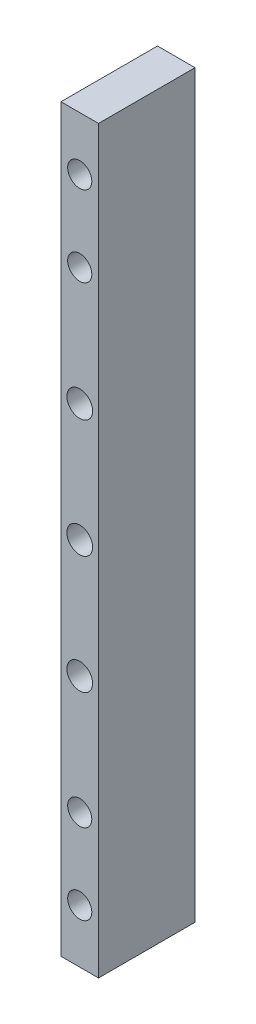
ISO-10303-21;
HEADER;
FILE_DESCRIPTION(('STEP AP214'),'2;1');
FILE_NAME('part.step','',(''),(''),'','','');
FILE_SCHEMA(('AUTOMOTIVE_DESIGN { 1 0 10303 214 1 1 1 1 }'));
ENDSEC;
DATA;
#1=APPLICATION_CONTEXT('core data for automotive mechanical design processes');
#2=APPLICATION_PROTOCOL_DEFINITION('international standard','automotive_design',2000,#1);
#3=PRODUCT_CONTEXT('',#1,'mechanical');
#4=PRODUCT('Part','Part','',(#3));
#5=PRODUCT_RELATED_PRODUCT_CATEGORY('part','',(#4));
#6=PRODUCT_DEFINITION_FORMATION('','',#4);
#7=PRODUCT_DEFINITION_CONTEXT('part definition',#1,'design');
#8=PRODUCT_DEFINITION('design','',#6,#7);
#9=PRODUCT_DEFINITION_SHAPE('','',#8);
#10=(LENGTH_UNIT() NAMED_UNIT(*) SI_UNIT(.MILLI.,.METRE.));
#11=(NAMED_UNIT(*) PLANE_ANGLE_UNIT() SI_UNIT($,.RADIAN.));
#12=(NAMED_UNIT(*) SI_UNIT($,.STERADIAN.) SOLID_ANGLE_UNIT());
#13=UNCERTAINTY_MEASURE_WITH_UNIT(LENGTH_MEASURE(1.E-05),#10,'distance_accuracy_value','');
#14=(GEOMETRIC_REPRESENTATION_CONTEXT(3) GLOBAL_UNCERTAINTY_ASSIGNED_CONTEXT((#13)) GLOBAL_UNIT_ASSIGNED_CONTEXT((#10,
#11,#12)) REPRESENTATION_CONTEXT('',''));
#15=CARTESIAN_POINT('',(0.,0.,0.));
#16=DIRECTION('',(0.,0.,1.));
#17=DIRECTION('',(1.,0.,0.));
#18=AXIS2_PLACEMENT_3D('',#15,#16,#17);
#19=CARTESIAN_POINT('',(3.49999999999999,69.,18.));
#20=DIRECTION('',(-1.,0.,0.));
#21=DIRECTION('',(0.,-1.,0.));
#22=AXIS2_PLACEMENT_3D('',#19,#20,#21);
#23=PLANE('',#22);
#24=DIRECTION('',(0.,1.,0.));
#25=VECTOR('',#24,1.);
#26=CARTESIAN_POINT('',(3.49999999999999,69.,0.));
#27=LINE('',#26,#25);
#28=CARTESIAN_POINT('',(3.50000000000001,-69.,0.));
#29=VERTEX_POINT('',#28);
#30=CARTESIAN_POINT('',(3.49999999999999,69.,0.));
#31=VERTEX_POINT('',#30);
#32=EDGE_CURVE('E96',#29,#31,#27,.T.);
#33=ORIENTED_EDGE('',*,*,#32,.T.);
#34=DIRECTION('',(0.,0.,-1.));
#35=VECTOR('',#34,1.);
#36=CARTESIAN_POINT('',(3.49999999999999,69.,18.));
#37=LINE('',#36,#35);
#38=CARTESIAN_POINT('',(3.49999999999999,69.,18.));
#39=VERTEX_POINT('',#38);
#40=EDGE_CURVE('E11',#39,#31,#37,.T.);
#41=ORIENTED_EDGE('',*,*,#40,.F.);
#42=DIRECTION('',(0.,1.,0.));
#43=VECTOR('',#42,1.);
#44=CARTESIAN_POINT('',(3.49999999999999,69.,18.));
#45=LINE('',#44,#43);
#46=CARTESIAN_POINT('',(3.50000000000001,-69.,18.));
#47=VERTEX_POINT('',#46);
#48=EDGE_CURVE('E84',#47,#39,#45,.T.);
#49=ORIENTED_EDGE('',*,*,#48,.F.);
#50=DIRECTION('',(0.,0.,-1.));
#51=VECTOR('',#50,1.);
#52=CARTESIAN_POINT('',(3.50000000000001,-69.,18.));
#53=LINE('',#52,#51);
#54=EDGE_CURVE('E92',#47,#29,#53,.T.);
#55=ORIENTED_EDGE('',*,*,#54,.T.);
#56=EDGE_LOOP('',(#33,#41,#49,#55));
#57=FACE_BOUND('',#56,.T.);
#58=ADVANCED_FACE('F33',(#57),#23,.F.);
#59=CARTESIAN_POINT('',(-3.50000000000001,69.,18.));
#60=DIRECTION('',(0.,-1.,0.));
#61=DIRECTION('',(0.,0.,-1.));
#62=AXIS2_PLACEMENT_3D('',#59,#60,#61);
#63=PLANE('',#62);
#64=DIRECTION('',(-1.,0.,0.));
#65=VECTOR('',#64,1.);
#66=CARTESIAN_POINT('',(-3.50000000000001,69.,0.));
#67=LINE('',#66,#65);
#68=CARTESIAN_POINT('',(-3.50000000000001,69.,0.));
#69=VERTEX_POINT('',#68);
#70=EDGE_CURVE('E88',#31,#69,#67,.T.);
#71=ORIENTED_EDGE('',*,*,#70,.T.);
#72=DIRECTION('',(0.,0.,-1.));
#73=VECTOR('',#72,1.);
#74=CARTESIAN_POINT('',(-3.50000000000001,69.,18.));
#75=LINE('',#74,#73);
#76=CARTESIAN_POINT('',(-3.50000000000001,69.,18.));
#77=VERTEX_POINT('',#76);
#78=EDGE_CURVE('E41',#77,#69,#75,.T.);
#79=ORIENTED_EDGE('',*,*,#78,.F.);
#80=DIRECTION('',(-1.,0.,0.));
#81=VECTOR('',#80,1.);
#82=CARTESIAN_POINT('',(-3.50000000000001,69.,18.));
#83=LINE('',#82,#81);
#84=EDGE_CURVE('E79',#39,#77,#83,.T.);
#85=ORIENTED_EDGE('',*,*,#84,.F.);
#86=ORIENTED_EDGE('',*,*,#40,.T.);
#87=EDGE_LOOP('',(#71,#79,#85,#86));
#88=FACE_BOUND('',#87,.T.);
#89=ADVANCED_FACE('F87',(#88),#63,.F.);
#90=CARTESIAN_POINT('',(-3.50000000000001,69.,18.));
#91=DIRECTION('',(1.,0.,0.));
#92=DIRECTION('',(0.,1.,0.));
#93=AXIS2_PLACEMENT_3D('',#90,#91,#92);
#94=PLANE('',#93);
#95=DIRECTION('',(0.,-1.,0.));
#96=VECTOR('',#95,1.);
#97=CARTESIAN_POINT('',(-3.50000000000001,69.,0.));
#98=LINE('',#97,#96);
#99=CARTESIAN_POINT('',(-3.49999999999999,-69.,0.));
#100=VERTEX_POINT('',#99);
#101=EDGE_CURVE('E66',#69,#100,#98,.T.);
#102=ORIENTED_EDGE('',*,*,#101,.T.);
#103=DIRECTION('',(0.,0.,-1.));
#104=VECTOR('',#103,1.);
#105=CARTESIAN_POINT('',(-3.49999999999999,-69.,18.));
#106=LINE('',#105,#104);
#107=CARTESIAN_POINT('',(-3.49999999999999,-69.,18.));
#108=VERTEX_POINT('',#107);
#109=EDGE_CURVE('E89',#108,#100,#106,.T.);
#110=ORIENTED_EDGE('',*,*,#109,.F.);
#111=DIRECTION('',(0.,-1.,0.));
#112=VECTOR('',#111,1.);
#113=CARTESIAN_POINT('',(-3.50000000000001,69.,18.));
#114=LINE('',#113,#112);
#115=EDGE_CURVE('E82',#77,#108,#114,.T.);
#116=ORIENTED_EDGE('',*,*,#115,.F.);
#117=ORIENTED_EDGE('',*,*,#78,.T.);
#118=EDGE_LOOP('',(#102,#110,#116,#117));
#119=FACE_BOUND('',#118,.T.);
#120=ADVANCED_FACE('F90',(#119),#94,.F.);
#121=CARTESIAN_POINT('',(-3.49999999999999,-69.,18.));
#122=DIRECTION('',(0.,1.,0.));
#123=DIRECTION('',(0.,0.,1.));
#124=AXIS2_PLACEMENT_3D('',#121,#122,#123);
#125=PLANE('',#124);
#126=DIRECTION('',(1.,0.,0.));
#127=VECTOR('',#126,1.);
#128=CARTESIAN_POINT('',(-3.49999999999999,-69.,0.));
#129=LINE('',#128,#127);
#130=EDGE_CURVE('E72',#100,#29,#129,.T.);
#131=ORIENTED_EDGE('',*,*,#130,.T.);
#132=ORIENTED_EDGE('',*,*,#54,.F.);
#133=DIRECTION('',(1.,0.,0.));
#134=VECTOR('',#133,1.);
#135=CARTESIAN_POINT('',(-3.49999999999999,-69.,18.));
#136=LINE('',#135,#134);
#137=EDGE_CURVE('E49',#108,#47,#136,.T.);
#138=ORIENTED_EDGE('',*,*,#137,.F.);
#139=ORIENTED_EDGE('',*,*,#109,.T.);
#140=EDGE_LOOP('',(#131,#132,#138,#139));
#141=FACE_BOUND('',#140,.T.);
#142=ADVANCED_FACE('F104',(#141),#125,.F.);
#143=CARTESIAN_POINT('',(0.,0.,18.));
#144=DIRECTION('',(0.,0.,1.));
#145=DIRECTION('',(1.,0.,0.));
#146=AXIS2_PLACEMENT_3D('',#143,#144,#145);
#147=PLANE('',#146);
#148=CARTESIAN_POINT('',(0.,-44.,18.));
#149=DIRECTION('',(0.,0.,1.));
#150=DIRECTION('',(1.,0.,0.));
#151=AXIS2_PLACEMENT_3D('',#148,#149,#150);
#152=CIRCLE('',#151,2.24999999999999);
#153=CARTESIAN_POINT('',(2.24999999999999,-44.,18.));
#154=VERTEX_POINT('',#153);
#155=EDGE_CURVE('E148',#154,#154,#152,.T.);
#156=ORIENTED_EDGE('',*,*,#155,.F.);
#157=EDGE_LOOP('',(#156));
#158=FACE_BOUND('',#157,.T.);
#159=CARTESIAN_POINT('',(0.,-59.,18.));
#160=DIRECTION('',(0.,0.,1.));
#161=DIRECTION('',(1.,0.,0.));
#162=AXIS2_PLACEMENT_3D('',#159,#160,#161);
#163=CIRCLE('',#162,2.24999999999999);
#164=CARTESIAN_POINT('',(2.24999999999999,-59.,18.));
#165=VERTEX_POINT('',#164);
#166=EDGE_CURVE('E142',#165,#165,#163,.T.);
#167=ORIENTED_EDGE('',*,*,#166,.F.);
#168=EDGE_LOOP('',(#167));
#169=FACE_BOUND('',#168,.T.);
#170=CARTESIAN_POINT('',(0.,44.,18.));
#171=DIRECTION('',(0.,0.,1.));
#172=DIRECTION('',(1.,0.,0.));
#173=AXIS2_PLACEMENT_3D('',#170,#171,#172);
#174=CIRCLE('',#173,2.24999999999999);
#175=CARTESIAN_POINT('',(2.24999999999999,44.,18.));
#176=VERTEX_POINT('',#175);
#177=EDGE_CURVE('E136',#176,#176,#174,.T.);
#178=ORIENTED_EDGE('',*,*,#177,.F.);
#179=EDGE_LOOP('',(#178));
#180=FACE_BOUND('',#179,.T.);
#181=CARTESIAN_POINT('',(0.,59.,18.));
#182=DIRECTION('',(0.,0.,1.));
#183=DIRECTION('',(1.,0.,0.));
#184=AXIS2_PLACEMENT_3D('',#181,#182,#183);
#185=CIRCLE('',#184,2.24999999999999);
#186=CARTESIAN_POINT('',(2.24999999999999,59.,18.));
#187=VERTEX_POINT('',#186);
#188=EDGE_CURVE('E130',#187,#187,#185,.T.);
#189=ORIENTED_EDGE('',*,*,#188,.F.);
#190=EDGE_LOOP('',(#189));
#191=FACE_BOUND('',#190,.T.);
#192=CARTESIAN_POINT('',(0.,0.,18.));
#193=DIRECTION('',(0.,0.,1.));
#194=DIRECTION('',(1.,0.,0.));
#195=AXIS2_PLACEMENT_3D('',#192,#193,#194);
#196=CIRCLE('',#195,2.4);
#197=CARTESIAN_POINT('',(2.4,0.,18.));
#198=VERTEX_POINT('',#197);
#199=EDGE_CURVE('E124',#198,#198,#196,.T.);
#200=ORIENTED_EDGE('',*,*,#199,.F.);
#201=EDGE_LOOP('',(#200));
#202=FACE_BOUND('',#201,.T.);
#203=CARTESIAN_POINT('',(0.,22.,18.));
#204=DIRECTION('',(0.,0.,1.));
#205=DIRECTION('',(1.,0.,0.));
#206=AXIS2_PLACEMENT_3D('',#203,#204,#205);
#207=CIRCLE('',#206,2.4);
#208=CARTESIAN_POINT('',(2.4,22.,18.));
#209=VERTEX_POINT('',#208);
#210=EDGE_CURVE('E118',#209,#209,#207,.T.);
#211=ORIENTED_EDGE('',*,*,#210,.F.);
#212=EDGE_LOOP('',(#211));
#213=FACE_BOUND('',#212,.T.);
#214=CARTESIAN_POINT('',(0.,-22.,18.));
#215=DIRECTION('',(0.,0.,1.));
#216=DIRECTION('',(1.,0.,0.));
#217=AXIS2_PLACEMENT_3D('',#214,#215,#216);
#218=CIRCLE('',#217,2.4);
#219=CARTESIAN_POINT('',(2.4,-22.,18.));
#220=VERTEX_POINT('',#219);
#221=EDGE_CURVE('E112',#220,#220,#218,.T.);
#222=ORIENTED_EDGE('',*,*,#221,.F.);
#223=EDGE_LOOP('',(#222));
#224=FACE_BOUND('',#223,.T.);
#225=ORIENTED_EDGE('',*,*,#48,.T.);
#226=ORIENTED_EDGE('',*,*,#84,.T.);
#227=ORIENTED_EDGE('',*,*,#115,.T.);
#228=ORIENTED_EDGE('',*,*,#137,.T.);
#229=EDGE_LOOP('',(#225,#226,#227,#228));
#230=FACE_BOUND('',#229,.T.);
#231=ADVANCED_FACE('F80',(#158,#169,#180,#191,#202,#213,#224,#230),#147,.T.);
#232=CARTESIAN_POINT('',(0.,0.,0.));
#233=DIRECTION('',(0.,0.,1.));
#234=DIRECTION('',(1.,0.,0.));
#235=AXIS2_PLACEMENT_3D('',#232,#233,#234);
#236=PLANE('',#235);
#237=CARTESIAN_POINT('',(0.,-44.,0.));
#238=DIRECTION('',(0.,0.,1.));
#239=DIRECTION('',(1.,0.,0.));
#240=AXIS2_PLACEMENT_3D('',#237,#238,#239);
#241=CIRCLE('',#240,2.25);
#242=CARTESIAN_POINT('',(2.25,-44.,0.));
#243=VERTEX_POINT('',#242);
#244=EDGE_CURVE('E145',#243,#243,#241,.T.);
#245=ORIENTED_EDGE('',*,*,#244,.T.);
#246=EDGE_LOOP('',(#245));
#247=FACE_BOUND('',#246,.T.);
#248=CARTESIAN_POINT('',(0.,-59.,0.));
#249=DIRECTION('',(0.,0.,1.));
#250=DIRECTION('',(1.,0.,0.));
#251=AXIS2_PLACEMENT_3D('',#248,#249,#250);
#252=CIRCLE('',#251,2.25);
#253=CARTESIAN_POINT('',(2.25,-59.,0.));
#254=VERTEX_POINT('',#253);
#255=EDGE_CURVE('E139',#254,#254,#252,.T.);
#256=ORIENTED_EDGE('',*,*,#255,.T.);
#257=EDGE_LOOP('',(#256));
#258=FACE_BOUND('',#257,.T.);
#259=CARTESIAN_POINT('',(0.,44.,0.));
#260=DIRECTION('',(0.,0.,1.));
#261=DIRECTION('',(1.,0.,0.));
#262=AXIS2_PLACEMENT_3D('',#259,#260,#261);
#263=CIRCLE('',#262,2.25);
#264=CARTESIAN_POINT('',(2.25,44.,0.));
#265=VERTEX_POINT('',#264);
#266=EDGE_CURVE('E133',#265,#265,#263,.T.);
#267=ORIENTED_EDGE('',*,*,#266,.T.);
#268=EDGE_LOOP('',(#267));
#269=FACE_BOUND('',#268,.T.);
#270=CARTESIAN_POINT('',(0.,59.,0.));
#271=DIRECTION('',(0.,0.,1.));
#272=DIRECTION('',(1.,0.,0.));
#273=AXIS2_PLACEMENT_3D('',#270,#271,#272);
#274=CIRCLE('',#273,2.25);
#275=CARTESIAN_POINT('',(2.25,59.,0.));
#276=VERTEX_POINT('',#275);
#277=EDGE_CURVE('E127',#276,#276,#274,.T.);
#278=ORIENTED_EDGE('',*,*,#277,.T.);
#279=EDGE_LOOP('',(#278));
#280=FACE_BOUND('',#279,.T.);
#281=CARTESIAN_POINT('',(0.,0.,0.));
#282=DIRECTION('',(0.,0.,1.));
#283=DIRECTION('',(1.,0.,0.));
#284=AXIS2_PLACEMENT_3D('',#281,#282,#283);
#285=CIRCLE('',#284,2.4);
#286=CARTESIAN_POINT('',(2.4,0.,0.));
#287=VERTEX_POINT('',#286);
#288=EDGE_CURVE('E121',#287,#287,#285,.T.);
#289=ORIENTED_EDGE('',*,*,#288,.T.);
#290=EDGE_LOOP('',(#289));
#291=FACE_BOUND('',#290,.T.);
#292=CARTESIAN_POINT('',(0.,22.,0.));
#293=DIRECTION('',(0.,0.,1.));
#294=DIRECTION('',(1.,0.,0.));
#295=AXIS2_PLACEMENT_3D('',#292,#293,#294);
#296=CIRCLE('',#295,2.4);
#297=CARTESIAN_POINT('',(2.4,22.,0.));
#298=VERTEX_POINT('',#297);
#299=EDGE_CURVE('E115',#298,#298,#296,.T.);
#300=ORIENTED_EDGE('',*,*,#299,.T.);
#301=EDGE_LOOP('',(#300));
#302=FACE_BOUND('',#301,.T.);
#303=CARTESIAN_POINT('',(0.,-22.,0.));
#304=DIRECTION('',(0.,0.,1.));
#305=DIRECTION('',(1.,0.,0.));
#306=AXIS2_PLACEMENT_3D('',#303,#304,#305);
#307=CIRCLE('',#306,2.4);
#308=CARTESIAN_POINT('',(2.4,-22.,0.));
#309=VERTEX_POINT('',#308);
#310=EDGE_CURVE('E99',#309,#309,#307,.T.);
#311=ORIENTED_EDGE('',*,*,#310,.T.);
#312=EDGE_LOOP('',(#311));
#313=FACE_BOUND('',#312,.T.);
#314=ORIENTED_EDGE('',*,*,#32,.F.);
#315=ORIENTED_EDGE('',*,*,#130,.F.);
#316=ORIENTED_EDGE('',*,*,#101,.F.);
#317=ORIENTED_EDGE('',*,*,#70,.F.);
#318=EDGE_LOOP('',(#314,#315,#316,#317));
#319=FACE_BOUND('',#318,.T.);
#320=ADVANCED_FACE('F107',(#247,#258,#269,#280,#291,#302,#313,#319),#236,.F.);
#321=CARTESIAN_POINT('',(0.,-22.,18.));
#322=DIRECTION('',(0.,0.,1.));
#323=DIRECTION('',(1.,0.,0.));
#324=AXIS2_PLACEMENT_3D('',#321,#322,#323);
#325=CYLINDRICAL_SURFACE('',#324,2.4);
#326=ORIENTED_EDGE('',*,*,#310,.F.);
#327=EDGE_LOOP('',(#326));
#328=FACE_BOUND('',#327,.T.);
#329=ORIENTED_EDGE('',*,*,#221,.T.);
#330=EDGE_LOOP('',(#329));
#331=FACE_BOUND('',#330,.T.);
#332=ADVANCED_FACE('F169',(#328,#331),#325,.F.);
#333=CARTESIAN_POINT('',(0.,22.,18.));
#334=DIRECTION('',(0.,0.,1.));
#335=DIRECTION('',(1.,0.,0.));
#336=AXIS2_PLACEMENT_3D('',#333,#334,#335);
#337=CYLINDRICAL_SURFACE('',#336,2.4);
#338=ORIENTED_EDGE('',*,*,#299,.F.);
#339=EDGE_LOOP('',(#338));
#340=FACE_BOUND('',#339,.T.);
#341=ORIENTED_EDGE('',*,*,#210,.T.);
#342=EDGE_LOOP('',(#341));
#343=FACE_BOUND('',#342,.T.);
#344=ADVANCED_FACE('F171',(#340,#343),#337,.F.);
#345=CARTESIAN_POINT('',(0.,0.,18.));
#346=DIRECTION('',(0.,0.,1.));
#347=DIRECTION('',(1.,0.,0.));
#348=AXIS2_PLACEMENT_3D('',#345,#346,#347);
#349=CYLINDRICAL_SURFACE('',#348,2.4);
#350=ORIENTED_EDGE('',*,*,#288,.F.);
#351=EDGE_LOOP('',(#350));
#352=FACE_BOUND('',#351,.T.);
#353=ORIENTED_EDGE('',*,*,#199,.T.);
#354=EDGE_LOOP('',(#353));
#355=FACE_BOUND('',#354,.T.);
#356=ADVANCED_FACE('F178',(#352,#355),#349,.F.);
#357=CARTESIAN_POINT('',(0.,59.,18.));
#358=DIRECTION('',(0.,0.,1.));
#359=DIRECTION('',(1.,0.,0.));
#360=AXIS2_PLACEMENT_3D('',#357,#358,#359);
#361=CYLINDRICAL_SURFACE('',#360,2.24999999999999);
#362=ORIENTED_EDGE('',*,*,#277,.F.);
#363=EDGE_LOOP('',(#362));
#364=FACE_BOUND('',#363,.T.);
#365=ORIENTED_EDGE('',*,*,#188,.T.);
#366=EDGE_LOOP('',(#365));
#367=FACE_BOUND('',#366,.T.);
#368=ADVANCED_FACE('F239',(#364,#367),#361,.F.);
#369=CARTESIAN_POINT('',(0.,44.,18.));
#370=DIRECTION('',(0.,0.,1.));
#371=DIRECTION('',(1.,0.,0.));
#372=AXIS2_PLACEMENT_3D('',#369,#370,#371);
#373=CYLINDRICAL_SURFACE('',#372,2.24999999999999);
#374=ORIENTED_EDGE('',*,*,#266,.F.);
#375=EDGE_LOOP('',(#374));
#376=FACE_BOUND('',#375,.T.);
#377=ORIENTED_EDGE('',*,*,#177,.T.);
#378=EDGE_LOOP('',(#377));
#379=FACE_BOUND('',#378,.T.);
#380=ADVANCED_FACE('F220',(#376,#379),#373,.F.);
#381=CARTESIAN_POINT('',(0.,-59.,18.));
#382=DIRECTION('',(0.,0.,1.));
#383=DIRECTION('',(1.,0.,0.));
#384=AXIS2_PLACEMENT_3D('',#381,#382,#383);
#385=CYLINDRICAL_SURFACE('',#384,2.24999999999999);
#386=ORIENTED_EDGE('',*,*,#255,.F.);
#387=EDGE_LOOP('',(#386));
#388=FACE_BOUND('',#387,.T.);
#389=ORIENTED_EDGE('',*,*,#166,.T.);
#390=EDGE_LOOP('',(#389));
#391=FACE_BOUND('',#390,.T.);
#392=ADVANCED_FACE('F215',(#388,#391),#385,.F.);
#393=CARTESIAN_POINT('',(0.,-44.,18.));
#394=DIRECTION('',(0.,0.,1.));
#395=DIRECTION('',(1.,0.,0.));
#396=AXIS2_PLACEMENT_3D('',#393,#394,#395);
#397=CYLINDRICAL_SURFACE('',#396,2.24999999999999);
#398=ORIENTED_EDGE('',*,*,#244,.F.);
#399=EDGE_LOOP('',(#398));
#400=FACE_BOUND('',#399,.T.);
#401=ORIENTED_EDGE('',*,*,#155,.T.);
#402=EDGE_LOOP('',(#401));
#403=FACE_BOUND('',#402,.T.);
#404=ADVANCED_FACE('F152',(#400,#403),#397,.F.);
#405=CLOSED_SHELL('',(#58,#89,#120,#142,#231,#320,#332,#344,#356,#368,#380,#392,#404));
#406=MANIFOLD_SOLID_BREP('B2',#405);
#407=ADVANCED_BREP_SHAPE_REPRESENTATION('',(#18,#406),#14);
#408=SHAPE_DEFINITION_REPRESENTATION(#9,#407);
ENDSEC;
END-ISO-10303-21;
